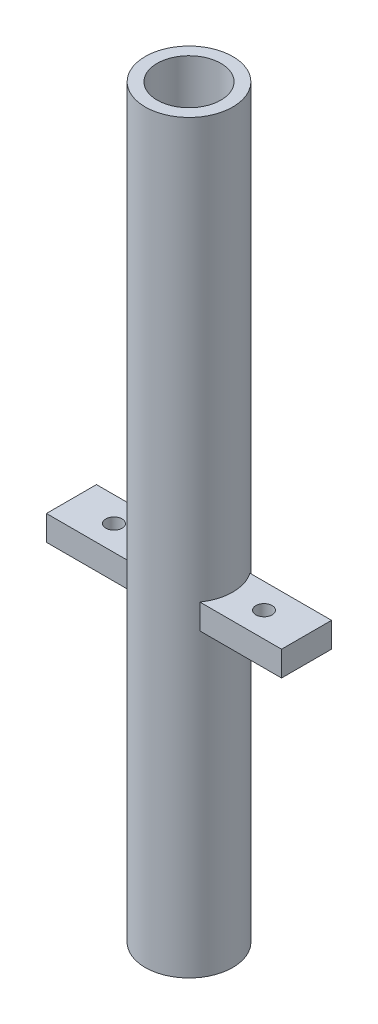
ISO-10303-21;
HEADER;
FILE_DESCRIPTION(('STEP AP214'),'2;1');
FILE_NAME('part.step','',(''),(''),'','','');
FILE_SCHEMA(('AUTOMOTIVE_DESIGN { 1 0 10303 214 1 1 1 1 }'));
ENDSEC;
DATA;
#1=APPLICATION_CONTEXT('core data for automotive mechanical design processes');
#2=APPLICATION_PROTOCOL_DEFINITION('international standard','automotive_design',2000,#1);
#3=PRODUCT_CONTEXT('',#1,'mechanical');
#4=PRODUCT('Part','Part','',(#3));
#5=PRODUCT_RELATED_PRODUCT_CATEGORY('part','',(#4));
#6=PRODUCT_DEFINITION_FORMATION('','',#4);
#7=PRODUCT_DEFINITION_CONTEXT('part definition',#1,'design');
#8=PRODUCT_DEFINITION('design','',#6,#7);
#9=PRODUCT_DEFINITION_SHAPE('','',#8);
#10=(LENGTH_UNIT() NAMED_UNIT(*) SI_UNIT(.MILLI.,.METRE.));
#11=(NAMED_UNIT(*) PLANE_ANGLE_UNIT() SI_UNIT($,.RADIAN.));
#12=(NAMED_UNIT(*) SI_UNIT($,.STERADIAN.) SOLID_ANGLE_UNIT());
#13=UNCERTAINTY_MEASURE_WITH_UNIT(LENGTH_MEASURE(1.E-05),#10,'distance_accuracy_value','');
#14=(GEOMETRIC_REPRESENTATION_CONTEXT(3) GLOBAL_UNCERTAINTY_ASSIGNED_CONTEXT((#13)) GLOBAL_UNIT_ASSIGNED_CONTEXT((#10,
#11,#12)) REPRESENTATION_CONTEXT('',''));
#15=CARTESIAN_POINT('',(0.,0.,0.));
#16=DIRECTION('',(0.,0.,1.));
#17=DIRECTION('',(1.,0.,0.));
#18=AXIS2_PLACEMENT_3D('',#15,#16,#17);
#19=CARTESIAN_POINT('',(0.,149.,0.));
#20=DIRECTION('',(0.,-1.,0.));
#21=DIRECTION('',(0.,0.,-1.));
#22=AXIS2_PLACEMENT_3D('',#19,#20,#21);
#23=CYLINDRICAL_SURFACE('',#22,17.5);
#24=DIRECTION('',(0.,-1.,0.));
#25=VECTOR('',#24,1.);
#26=CARTESIAN_POINT('',(-14.3614066163451,149.,-10.));
#27=LINE('',#26,#25);
#28=CARTESIAN_POINT('',(-14.3614066163451,-29.,-10.));
#29=VERTEX_POINT('',#28);
#30=CARTESIAN_POINT('',(-14.3614066163451,-19.,-10.));
#31=VERTEX_POINT('',#30);
#32=EDGE_CURVE('E52',#29,#31,#27,.F.);
#33=ORIENTED_EDGE('',*,*,#32,.T.);
#34=CARTESIAN_POINT('',(0.,-19.,0.));
#35=DIRECTION('',(0.,1.,0.));
#36=DIRECTION('',(0.,0.,1.));
#37=AXIS2_PLACEMENT_3D('',#34,#35,#36);
#38=CIRCLE('',#37,17.5);
#39=CARTESIAN_POINT('',(-14.3614066163451,-19.,9.99999999999999));
#40=VERTEX_POINT('',#39);
#41=EDGE_CURVE('E47',#31,#40,#38,.T.);
#42=ORIENTED_EDGE('',*,*,#41,.T.);
#43=DIRECTION('',(0.,-1.,0.));
#44=VECTOR('',#43,1.);
#45=CARTESIAN_POINT('',(-14.3614066163451,149.,9.99999999999999));
#46=LINE('',#45,#44);
#47=CARTESIAN_POINT('',(-14.3614066163451,-29.,9.99999999999999));
#48=VERTEX_POINT('',#47);
#49=EDGE_CURVE('E135',#40,#48,#46,.T.);
#50=ORIENTED_EDGE('',*,*,#49,.T.);
#51=CARTESIAN_POINT('',(0.,-29.,0.));
#52=DIRECTION('',(0.,1.,0.));
#53=DIRECTION('',(0.,0.,1.));
#54=AXIS2_PLACEMENT_3D('',#51,#52,#53);
#55=CIRCLE('',#54,17.5);
#56=EDGE_CURVE('E129',#29,#48,#55,.T.);
#57=ORIENTED_EDGE('',*,*,#56,.F.);
#58=EDGE_LOOP('',(#33,#42,#50,#57));
#59=FACE_BOUND('',#58,.T.);
#60=CARTESIAN_POINT('',(0.,-149.,0.));
#61=DIRECTION('',(0.,1.,0.));
#62=DIRECTION('',(0.,0.,1.));
#63=AXIS2_PLACEMENT_3D('',#60,#61,#62);
#64=CIRCLE('',#63,17.5);
#65=CARTESIAN_POINT('',(0.,-149.,17.5));
#66=VERTEX_POINT('',#65);
#67=EDGE_CURVE('E36',#66,#66,#64,.T.);
#68=ORIENTED_EDGE('',*,*,#67,.T.);
#69=EDGE_LOOP('',(#68));
#70=FACE_BOUND('',#69,.T.);
#71=CARTESIAN_POINT('',(0.,149.,0.));
#72=DIRECTION('',(0.,1.,0.));
#73=DIRECTION('',(0.,0.,1.));
#74=AXIS2_PLACEMENT_3D('',#71,#72,#73);
#75=CIRCLE('',#74,17.5);
#76=CARTESIAN_POINT('',(0.,149.,17.5));
#77=VERTEX_POINT('',#76);
#78=EDGE_CURVE('E11',#77,#77,#75,.T.);
#79=ORIENTED_EDGE('',*,*,#78,.F.);
#80=EDGE_LOOP('',(#79));
#81=FACE_BOUND('',#80,.T.);
#82=CARTESIAN_POINT('',(0.,-19.,0.));
#83=DIRECTION('',(0.,-1.,0.));
#84=DIRECTION('',(0.,0.,-1.));
#85=AXIS2_PLACEMENT_3D('',#82,#83,#84);
#86=CIRCLE('',#85,17.5);
#87=CARTESIAN_POINT('',(14.3614066163451,-19.,-10.));
#88=VERTEX_POINT('',#87);
#89=CARTESIAN_POINT('',(14.3614066163451,-19.,10.));
#90=VERTEX_POINT('',#89);
#91=EDGE_CURVE('E166',#88,#90,#86,.T.);
#92=ORIENTED_EDGE('',*,*,#91,.F.);
#93=DIRECTION('',(0.,-1.,0.));
#94=VECTOR('',#93,1.);
#95=CARTESIAN_POINT('',(14.3614066163451,149.,-10.));
#96=LINE('',#95,#94);
#97=CARTESIAN_POINT('',(14.3614066163451,-29.,-10.));
#98=VERTEX_POINT('',#97);
#99=EDGE_CURVE('E171',#88,#98,#96,.T.);
#100=ORIENTED_EDGE('',*,*,#99,.T.);
#101=CARTESIAN_POINT('',(0.,-29.,0.));
#102=DIRECTION('',(0.,-1.,0.));
#103=DIRECTION('',(0.,0.,-1.));
#104=AXIS2_PLACEMENT_3D('',#101,#102,#103);
#105=CIRCLE('',#104,17.5);
#106=CARTESIAN_POINT('',(14.3614066163451,-29.,10.));
#107=VERTEX_POINT('',#106);
#108=EDGE_CURVE('E161',#98,#107,#105,.T.);
#109=ORIENTED_EDGE('',*,*,#108,.T.);
#110=DIRECTION('',(0.,-1.,0.));
#111=VECTOR('',#110,1.);
#112=CARTESIAN_POINT('',(14.3614066163451,149.,10.));
#113=LINE('',#112,#111);
#114=EDGE_CURVE('E168',#107,#90,#113,.F.);
#115=ORIENTED_EDGE('',*,*,#114,.T.);
#116=EDGE_LOOP('',(#92,#100,#109,#115));
#117=FACE_BOUND('',#116,.T.);
#118=ADVANCED_FACE('F33',(#59,#70,#81,#117),#23,.T.);
#119=CARTESIAN_POINT('',(0.,149.,0.));
#120=DIRECTION('',(0.,1.,0.));
#121=DIRECTION('',(0.,0.,1.));
#122=AXIS2_PLACEMENT_3D('',#119,#120,#121);
#123=PLANE('',#122);
#124=ORIENTED_EDGE('',*,*,#78,.T.);
#125=EDGE_LOOP('',(#124));
#126=FACE_BOUND('',#125,.T.);
#127=CARTESIAN_POINT('',(0.,149.,0.));
#128=DIRECTION('',(0.,1.,0.));
#129=DIRECTION('',(0.,0.,1.));
#130=AXIS2_PLACEMENT_3D('',#127,#128,#129);
#131=CIRCLE('',#130,12.75);
#132=CARTESIAN_POINT('',(0.,149.,12.75));
#133=VERTEX_POINT('',#132);
#134=EDGE_CURVE('E175',#133,#133,#131,.T.);
#135=ORIENTED_EDGE('',*,*,#134,.F.);
#136=EDGE_LOOP('',(#135));
#137=FACE_BOUND('',#136,.T.);
#138=ADVANCED_FACE('F195',(#126,#137),#123,.T.);
#139=CARTESIAN_POINT('',(0.,-149.,0.));
#140=DIRECTION('',(0.,1.,0.));
#141=DIRECTION('',(0.,0.,1.));
#142=AXIS2_PLACEMENT_3D('',#139,#140,#141);
#143=PLANE('',#142);
#144=ORIENTED_EDGE('',*,*,#67,.F.);
#145=EDGE_LOOP('',(#144));
#146=FACE_BOUND('',#145,.T.);
#147=CARTESIAN_POINT('',(0.,-149.,0.));
#148=DIRECTION('',(0.,1.,0.));
#149=DIRECTION('',(0.,0.,1.));
#150=AXIS2_PLACEMENT_3D('',#147,#148,#149);
#151=CIRCLE('',#150,12.75);
#152=CARTESIAN_POINT('',(0.,-149.,12.75));
#153=VERTEX_POINT('',#152);
#154=EDGE_CURVE('E174',#153,#153,#151,.T.);
#155=ORIENTED_EDGE('',*,*,#154,.T.);
#156=EDGE_LOOP('',(#155));
#157=FACE_BOUND('',#156,.T.);
#158=ADVANCED_FACE('F181',(#146,#157),#143,.F.);
#159=CARTESIAN_POINT('',(0.,149.,0.));
#160=DIRECTION('',(0.,-1.,0.));
#161=DIRECTION('',(0.,0.,-1.));
#162=AXIS2_PLACEMENT_3D('',#159,#160,#161);
#163=CYLINDRICAL_SURFACE('',#162,12.75);
#164=ORIENTED_EDGE('',*,*,#134,.T.);
#165=EDGE_LOOP('',(#164));
#166=FACE_BOUND('',#165,.T.);
#167=ORIENTED_EDGE('',*,*,#154,.F.);
#168=EDGE_LOOP('',(#167));
#169=FACE_BOUND('',#168,.T.);
#170=ADVANCED_FACE('F183',(#166,#169),#163,.F.);
#171=CARTESIAN_POINT('',(7.90964600977818,-19.,-10.));
#172=DIRECTION('',(0.,0.,-1.));
#173=DIRECTION('',(-1.,0.,0.));
#174=AXIS2_PLACEMENT_3D('',#171,#172,#173);
#175=PLANE('',#174);
#176=ORIENTED_EDGE('',*,*,#99,.F.);
#177=DIRECTION('',(1.,0.,0.));
#178=VECTOR('',#177,1.);
#179=CARTESIAN_POINT('',(7.90964600977818,-19.,-10.));
#180=LINE('',#179,#178);
#181=CARTESIAN_POINT('',(47.,-19.,-10.));
#182=VERTEX_POINT('',#181);
#183=EDGE_CURVE('E144',#88,#182,#180,.T.);
#184=ORIENTED_EDGE('',*,*,#183,.T.);
#185=DIRECTION('',(0.,-1.,0.));
#186=VECTOR('',#185,1.);
#187=CARTESIAN_POINT('',(47.,-19.,-10.));
#188=LINE('',#187,#186);
#189=CARTESIAN_POINT('',(47.,-29.,-10.));
#190=VERTEX_POINT('',#189);
#191=EDGE_CURVE('E153',#182,#190,#188,.T.);
#192=ORIENTED_EDGE('',*,*,#191,.T.);
#193=DIRECTION('',(1.,0.,0.));
#194=VECTOR('',#193,1.);
#195=CARTESIAN_POINT('',(7.90964600977818,-29.,-10.));
#196=LINE('',#195,#194);
#197=EDGE_CURVE('E141',#98,#190,#196,.T.);
#198=ORIENTED_EDGE('',*,*,#197,.F.);
#199=EDGE_LOOP('',(#176,#184,#192,#198));
#200=FACE_BOUND('',#199,.T.);
#201=ADVANCED_FACE('F185',(#200),#175,.T.);
#202=CARTESIAN_POINT('',(7.90964600977819,-19.,10.));
#203=DIRECTION('',(0.,0.,1.));
#204=DIRECTION('',(1.,0.,0.));
#205=AXIS2_PLACEMENT_3D('',#202,#203,#204);
#206=PLANE('',#205);
#207=ORIENTED_EDGE('',*,*,#114,.F.);
#208=DIRECTION('',(-1.,0.,0.));
#209=VECTOR('',#208,1.);
#210=CARTESIAN_POINT('',(7.90964600977819,-29.,10.));
#211=LINE('',#210,#209);
#212=CARTESIAN_POINT('',(47.,-29.,10.));
#213=VERTEX_POINT('',#212);
#214=EDGE_CURVE('E147',#213,#107,#211,.T.);
#215=ORIENTED_EDGE('',*,*,#214,.F.);
#216=DIRECTION('',(0.,-1.,0.));
#217=VECTOR('',#216,1.);
#218=CARTESIAN_POINT('',(47.,-19.,10.));
#219=LINE('',#218,#217);
#220=CARTESIAN_POINT('',(47.,-19.,10.));
#221=VERTEX_POINT('',#220);
#222=EDGE_CURVE('E159',#221,#213,#219,.T.);
#223=ORIENTED_EDGE('',*,*,#222,.F.);
#224=DIRECTION('',(-1.,0.,0.));
#225=VECTOR('',#224,1.);
#226=CARTESIAN_POINT('',(7.90964600977819,-19.,10.));
#227=LINE('',#226,#225);
#228=EDGE_CURVE('E150',#221,#90,#227,.T.);
#229=ORIENTED_EDGE('',*,*,#228,.T.);
#230=EDGE_LOOP('',(#207,#215,#223,#229));
#231=FACE_BOUND('',#230,.T.);
#232=ADVANCED_FACE('F192',(#231),#206,.T.);
#233=CARTESIAN_POINT('',(0.,-19.,0.));
#234=DIRECTION('',(0.,-1.,0.));
#235=DIRECTION('',(0.,0.,-1.));
#236=AXIS2_PLACEMENT_3D('',#233,#234,#235);
#237=PLANE('',#236);
#238=CARTESIAN_POINT('',(30.,-19.,0.));
#239=DIRECTION('',(0.,-1.,0.));
#240=DIRECTION('',(0.,0.,-1.));
#241=AXIS2_PLACEMENT_3D('',#238,#239,#240);
#242=CIRCLE('',#241,3.25);
#243=CARTESIAN_POINT('',(30.,-19.,-3.25));
#244=VERTEX_POINT('',#243);
#245=EDGE_CURVE('E138',#244,#244,#242,.T.);
#246=ORIENTED_EDGE('',*,*,#245,.T.);
#247=EDGE_LOOP('',(#246));
#248=FACE_BOUND('',#247,.T.);
#249=ORIENTED_EDGE('',*,*,#183,.F.);
#250=ORIENTED_EDGE('',*,*,#91,.T.);
#251=ORIENTED_EDGE('',*,*,#228,.F.);
#252=DIRECTION('',(0.,0.,1.));
#253=VECTOR('',#252,1.);
#254=CARTESIAN_POINT('',(47.,-19.,10.));
#255=LINE('',#254,#253);
#256=EDGE_CURVE('E146',#182,#221,#255,.T.);
#257=ORIENTED_EDGE('',*,*,#256,.F.);
#258=EDGE_LOOP('',(#249,#250,#251,#257));
#259=FACE_BOUND('',#258,.T.);
#260=ADVANCED_FACE('F214',(#248,#259),#237,.F.);
#261=CARTESIAN_POINT('',(0.,-29.,0.));
#262=DIRECTION('',(0.,-1.,0.));
#263=DIRECTION('',(0.,0.,-1.));
#264=AXIS2_PLACEMENT_3D('',#261,#262,#263);
#265=PLANE('',#264);
#266=CARTESIAN_POINT('',(30.,-29.,0.));
#267=DIRECTION('',(0.,-1.,0.));
#268=DIRECTION('',(0.,0.,-1.));
#269=AXIS2_PLACEMENT_3D('',#266,#267,#268);
#270=CIRCLE('',#269,3.25);
#271=CARTESIAN_POINT('',(30.,-29.,-3.25));
#272=VERTEX_POINT('',#271);
#273=EDGE_CURVE('E137',#272,#272,#270,.T.);
#274=ORIENTED_EDGE('',*,*,#273,.F.);
#275=EDGE_LOOP('',(#274));
#276=FACE_BOUND('',#275,.T.);
#277=ORIENTED_EDGE('',*,*,#108,.F.);
#278=ORIENTED_EDGE('',*,*,#197,.T.);
#279=DIRECTION('',(0.,0.,1.));
#280=VECTOR('',#279,1.);
#281=CARTESIAN_POINT('',(47.,-29.,10.));
#282=LINE('',#281,#280);
#283=EDGE_CURVE('E155',#190,#213,#282,.T.);
#284=ORIENTED_EDGE('',*,*,#283,.T.);
#285=ORIENTED_EDGE('',*,*,#214,.T.);
#286=EDGE_LOOP('',(#277,#278,#284,#285));
#287=FACE_BOUND('',#286,.T.);
#288=ADVANCED_FACE('F224',(#276,#287),#265,.T.);
#289=CARTESIAN_POINT('',(47.,-19.,10.));
#290=DIRECTION('',(1.,0.,0.));
#291=DIRECTION('',(0.,0.,-1.));
#292=AXIS2_PLACEMENT_3D('',#289,#290,#291);
#293=PLANE('',#292);
#294=ORIENTED_EDGE('',*,*,#283,.F.);
#295=ORIENTED_EDGE('',*,*,#191,.F.);
#296=ORIENTED_EDGE('',*,*,#256,.T.);
#297=ORIENTED_EDGE('',*,*,#222,.T.);
#298=EDGE_LOOP('',(#294,#295,#296,#297));
#299=FACE_BOUND('',#298,.T.);
#300=ADVANCED_FACE('F220',(#299),#293,.T.);
#301=CARTESIAN_POINT('',(30.,-19.,0.));
#302=DIRECTION('',(0.,-1.,0.));
#303=DIRECTION('',(0.,0.,-1.));
#304=AXIS2_PLACEMENT_3D('',#301,#302,#303);
#305=CYLINDRICAL_SURFACE('',#304,3.25);
#306=ORIENTED_EDGE('',*,*,#245,.F.);
#307=EDGE_LOOP('',(#306));
#308=FACE_BOUND('',#307,.T.);
#309=ORIENTED_EDGE('',*,*,#273,.T.);
#310=EDGE_LOOP('',(#309));
#311=FACE_BOUND('',#310,.T.);
#312=ADVANCED_FACE('F232',(#308,#311),#305,.F.);
#313=CARTESIAN_POINT('',(-47.,-19.,9.99999999999999));
#314=DIRECTION('',(0.,0.,1.));
#315=DIRECTION('',(1.,0.,0.));
#316=AXIS2_PLACEMENT_3D('',#313,#314,#315);
#317=PLANE('',#316);
#318=ORIENTED_EDGE('',*,*,#49,.F.);
#319=DIRECTION('',(-1.,0.,0.));
#320=VECTOR('',#319,1.);
#321=CARTESIAN_POINT('',(-47.,-19.,9.99999999999999));
#322=LINE('',#321,#320);
#323=CARTESIAN_POINT('',(-47.,-19.,9.99999999999999));
#324=VERTEX_POINT('',#323);
#325=EDGE_CURVE('E106',#40,#324,#322,.T.);
#326=ORIENTED_EDGE('',*,*,#325,.T.);
#327=DIRECTION('',(0.,-1.,0.));
#328=VECTOR('',#327,1.);
#329=CARTESIAN_POINT('',(-47.,-19.,9.99999999999999));
#330=LINE('',#329,#328);
#331=CARTESIAN_POINT('',(-47.,-29.,9.99999999999999));
#332=VERTEX_POINT('',#331);
#333=EDGE_CURVE('E105',#324,#332,#330,.T.);
#334=ORIENTED_EDGE('',*,*,#333,.T.);
#335=DIRECTION('',(-1.,0.,0.));
#336=VECTOR('',#335,1.);
#337=CARTESIAN_POINT('',(-47.,-29.,9.99999999999999));
#338=LINE('',#337,#336);
#339=EDGE_CURVE('E117',#48,#332,#338,.T.);
#340=ORIENTED_EDGE('',*,*,#339,.F.);
#341=EDGE_LOOP('',(#318,#326,#334,#340));
#342=FACE_BOUND('',#341,.T.);
#343=ADVANCED_FACE('F269',(#342),#317,.T.);
#344=CARTESIAN_POINT('',(-47.,-19.,-10.));
#345=DIRECTION('',(0.,0.,-1.));
#346=DIRECTION('',(-1.,0.,0.));
#347=AXIS2_PLACEMENT_3D('',#344,#345,#346);
#348=PLANE('',#347);
#349=ORIENTED_EDGE('',*,*,#32,.F.);
#350=DIRECTION('',(1.,0.,0.));
#351=VECTOR('',#350,1.);
#352=CARTESIAN_POINT('',(-47.,-29.,-10.));
#353=LINE('',#352,#351);
#354=CARTESIAN_POINT('',(-47.,-29.,-10.));
#355=VERTEX_POINT('',#354);
#356=EDGE_CURVE('E100',#355,#29,#353,.T.);
#357=ORIENTED_EDGE('',*,*,#356,.F.);
#358=DIRECTION('',(0.,-1.,0.));
#359=VECTOR('',#358,1.);
#360=CARTESIAN_POINT('',(-47.,-19.,-10.));
#361=LINE('',#360,#359);
#362=CARTESIAN_POINT('',(-47.,-19.,-10.));
#363=VERTEX_POINT('',#362);
#364=EDGE_CURVE('E95',#363,#355,#361,.T.);
#365=ORIENTED_EDGE('',*,*,#364,.F.);
#366=DIRECTION('',(1.,0.,0.));
#367=VECTOR('',#366,1.);
#368=CARTESIAN_POINT('',(-47.,-19.,-10.));
#369=LINE('',#368,#367);
#370=EDGE_CURVE('E98',#363,#31,#369,.T.);
#371=ORIENTED_EDGE('',*,*,#370,.T.);
#372=EDGE_LOOP('',(#349,#357,#365,#371));
#373=FACE_BOUND('',#372,.T.);
#374=ADVANCED_FACE('F97',(#373),#348,.T.);
#375=CARTESIAN_POINT('',(0.,-19.,0.));
#376=DIRECTION('',(0.,1.,0.));
#377=DIRECTION('',(0.,0.,1.));
#378=AXIS2_PLACEMENT_3D('',#375,#376,#377);
#379=PLANE('',#378);
#380=CARTESIAN_POINT('',(-30.,-19.,0.));
#381=DIRECTION('',(0.,-1.,0.));
#382=DIRECTION('',(0.,0.,1.));
#383=AXIS2_PLACEMENT_3D('',#380,#381,#382);
#384=CIRCLE('',#383,3.25);
#385=CARTESIAN_POINT('',(-30.,-19.,3.25));
#386=VERTEX_POINT('',#385);
#387=EDGE_CURVE('E127',#386,#386,#384,.T.);
#388=ORIENTED_EDGE('',*,*,#387,.T.);
#389=EDGE_LOOP('',(#388));
#390=FACE_BOUND('',#389,.T.);
#391=ORIENTED_EDGE('',*,*,#41,.F.);
#392=ORIENTED_EDGE('',*,*,#370,.F.);
#393=DIRECTION('',(0.,0.,-1.));
#394=VECTOR('',#393,1.);
#395=CARTESIAN_POINT('',(-47.,-19.,9.99999999999999));
#396=LINE('',#395,#394);
#397=EDGE_CURVE('E112',#324,#363,#396,.T.);
#398=ORIENTED_EDGE('',*,*,#397,.F.);
#399=ORIENTED_EDGE('',*,*,#325,.F.);
#400=EDGE_LOOP('',(#391,#392,#398,#399));
#401=FACE_BOUND('',#400,.T.);
#402=ADVANCED_FACE('F110',(#390,#401),#379,.T.);
#403=CARTESIAN_POINT('',(0.,-29.,0.));
#404=DIRECTION('',(0.,1.,0.));
#405=DIRECTION('',(0.,0.,1.));
#406=AXIS2_PLACEMENT_3D('',#403,#404,#405);
#407=PLANE('',#406);
#408=CARTESIAN_POINT('',(-30.,-29.,0.));
#409=DIRECTION('',(0.,-1.,0.));
#410=DIRECTION('',(0.,0.,1.));
#411=AXIS2_PLACEMENT_3D('',#408,#409,#410);
#412=CIRCLE('',#411,3.25);
#413=CARTESIAN_POINT('',(-30.,-29.,3.25));
#414=VERTEX_POINT('',#413);
#415=EDGE_CURVE('E121',#414,#414,#412,.T.);
#416=ORIENTED_EDGE('',*,*,#415,.F.);
#417=EDGE_LOOP('',(#416));
#418=FACE_BOUND('',#417,.T.);
#419=ORIENTED_EDGE('',*,*,#356,.T.);
#420=ORIENTED_EDGE('',*,*,#56,.T.);
#421=ORIENTED_EDGE('',*,*,#339,.T.);
#422=DIRECTION('',(0.,0.,-1.));
#423=VECTOR('',#422,1.);
#424=CARTESIAN_POINT('',(-47.,-29.,9.99999999999999));
#425=LINE('',#424,#423);
#426=EDGE_CURVE('E125',#332,#355,#425,.T.);
#427=ORIENTED_EDGE('',*,*,#426,.T.);
#428=EDGE_LOOP('',(#419,#420,#421,#427));
#429=FACE_BOUND('',#428,.T.);
#430=ADVANCED_FACE('F295',(#418,#429),#407,.F.);
#431=CARTESIAN_POINT('',(-47.,-19.,9.99999999999999));
#432=DIRECTION('',(-1.,0.,0.));
#433=DIRECTION('',(0.,0.,1.));
#434=AXIS2_PLACEMENT_3D('',#431,#432,#433);
#435=PLANE('',#434);
#436=ORIENTED_EDGE('',*,*,#426,.F.);
#437=ORIENTED_EDGE('',*,*,#333,.F.);
#438=ORIENTED_EDGE('',*,*,#397,.T.);
#439=ORIENTED_EDGE('',*,*,#364,.T.);
#440=EDGE_LOOP('',(#436,#437,#438,#439));
#441=FACE_BOUND('',#440,.T.);
#442=ADVANCED_FACE('F115',(#441),#435,.T.);
#443=CARTESIAN_POINT('',(-30.,-19.,0.));
#444=DIRECTION('',(0.,-1.,0.));
#445=DIRECTION('',(0.,0.,-1.));
#446=AXIS2_PLACEMENT_3D('',#443,#444,#445);
#447=CYLINDRICAL_SURFACE('',#446,3.25);
#448=ORIENTED_EDGE('',*,*,#387,.F.);
#449=EDGE_LOOP('',(#448));
#450=FACE_BOUND('',#449,.T.);
#451=ORIENTED_EDGE('',*,*,#415,.T.);
#452=EDGE_LOOP('',(#451));
#453=FACE_BOUND('',#452,.T.);
#454=ADVANCED_FACE('F314',(#450,#453),#447,.F.);
#455=CLOSED_SHELL('',(#118,#138,#158,#170,#201,#232,#260,#288,#300,#312,#343,#374,#402,#430,
#442,#454));
#456=MANIFOLD_SOLID_BREP('B2',#455);
#457=ADVANCED_BREP_SHAPE_REPRESENTATION('',(#18,#456),#14);
#458=SHAPE_DEFINITION_REPRESENTATION(#9,#457);
ENDSEC;
END-ISO-10303-21;
